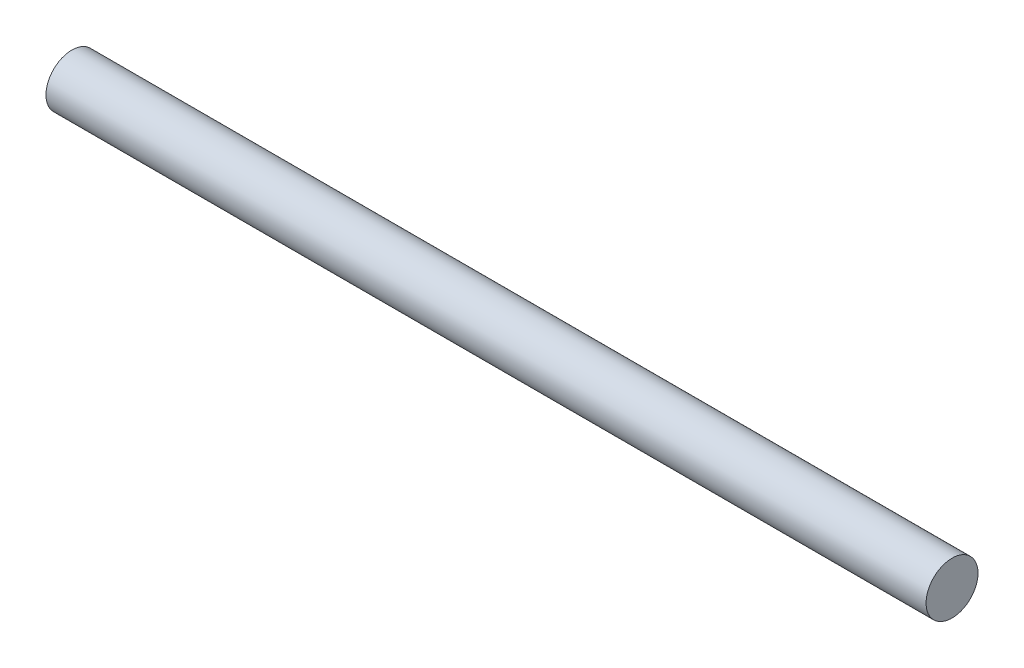
ISO-10303-21;
HEADER;
FILE_DESCRIPTION(('STEP AP214'),'2;1');
FILE_NAME('part.step','',(''),(''),'','','');
FILE_SCHEMA(('AUTOMOTIVE_DESIGN { 1 0 10303 214 1 1 1 1 }'));
ENDSEC;
DATA;
#1=APPLICATION_CONTEXT('core data for automotive mechanical design processes');
#2=APPLICATION_PROTOCOL_DEFINITION('international standard','automotive_design',2000,#1);
#3=PRODUCT_CONTEXT('',#1,'mechanical');
#4=PRODUCT('Part','Part','',(#3));
#5=PRODUCT_RELATED_PRODUCT_CATEGORY('part','',(#4));
#6=PRODUCT_DEFINITION_FORMATION('','',#4);
#7=PRODUCT_DEFINITION_CONTEXT('part definition',#1,'design');
#8=PRODUCT_DEFINITION('design','',#6,#7);
#9=PRODUCT_DEFINITION_SHAPE('','',#8);
#10=(LENGTH_UNIT() NAMED_UNIT(*) SI_UNIT(.MILLI.,.METRE.));
#11=(NAMED_UNIT(*) PLANE_ANGLE_UNIT() SI_UNIT($,.RADIAN.));
#12=(NAMED_UNIT(*) SI_UNIT($,.STERADIAN.) SOLID_ANGLE_UNIT());
#13=UNCERTAINTY_MEASURE_WITH_UNIT(LENGTH_MEASURE(1.E-05),#10,'distance_accuracy_value','');
#14=(GEOMETRIC_REPRESENTATION_CONTEXT(3) GLOBAL_UNCERTAINTY_ASSIGNED_CONTEXT((#13)) GLOBAL_UNIT_ASSIGNED_CONTEXT((#10,
#11,#12)) REPRESENTATION_CONTEXT('',''));
#15=CARTESIAN_POINT('',(0.,0.,0.));
#16=DIRECTION('',(0.,0.,1.));
#17=DIRECTION('',(1.,0.,0.));
#18=AXIS2_PLACEMENT_3D('',#15,#16,#17);
#19=CARTESIAN_POINT('',(50.,0.,0.));
#20=DIRECTION('',(-1.,0.,0.));
#21=DIRECTION('',(0.,0.,1.));
#22=AXIS2_PLACEMENT_3D('',#19,#20,#21);
#23=CYLINDRICAL_SURFACE('',#22,1.475);
#24=CARTESIAN_POINT('',(50.,0.,0.));
#25=DIRECTION('',(1.,0.,0.));
#26=DIRECTION('',(0.,0.,-1.));
#27=AXIS2_PLACEMENT_3D('',#24,#25,#26);
#28=CIRCLE('',#27,1.475);
#29=CARTESIAN_POINT('',(50.,0.,-1.475));
#30=VERTEX_POINT('',#29);
#31=EDGE_CURVE('E10',#30,#30,#28,.T.);
#32=ORIENTED_EDGE('',*,*,#31,.F.);
#33=EDGE_LOOP('',(#32));
#34=FACE_BOUND('',#33,.T.);
#35=CARTESIAN_POINT('',(0.,0.,0.));
#36=DIRECTION('',(1.,0.,0.));
#37=DIRECTION('',(0.,0.,-1.));
#38=AXIS2_PLACEMENT_3D('',#35,#36,#37);
#39=CIRCLE('',#38,1.475);
#40=CARTESIAN_POINT('',(0.,0.,-1.475));
#41=VERTEX_POINT('',#40);
#42=EDGE_CURVE('E35',#41,#41,#39,.T.);
#43=ORIENTED_EDGE('',*,*,#42,.T.);
#44=EDGE_LOOP('',(#43));
#45=FACE_BOUND('',#44,.T.);
#46=ADVANCED_FACE('F32',(#34,#45),#23,.T.);
#47=CARTESIAN_POINT('',(50.,0.,0.));
#48=DIRECTION('',(1.,0.,0.));
#49=DIRECTION('',(0.,0.,-1.));
#50=AXIS2_PLACEMENT_3D('',#47,#48,#49);
#51=PLANE('',#50);
#52=ORIENTED_EDGE('',*,*,#31,.T.);
#53=EDGE_LOOP('',(#52));
#54=FACE_BOUND('',#53,.T.);
#55=ADVANCED_FACE('F47',(#54),#51,.T.);
#56=CARTESIAN_POINT('',(0.,0.,0.));
#57=DIRECTION('',(1.,0.,0.));
#58=DIRECTION('',(0.,0.,-1.));
#59=AXIS2_PLACEMENT_3D('',#56,#57,#58);
#60=PLANE('',#59);
#61=ORIENTED_EDGE('',*,*,#42,.F.);
#62=EDGE_LOOP('',(#61));
#63=FACE_BOUND('',#62,.T.);
#64=ADVANCED_FACE('F45',(#63),#60,.F.);
#65=CLOSED_SHELL('',(#46,#55,#64));
#66=MANIFOLD_SOLID_BREP('B2',#65);
#67=ADVANCED_BREP_SHAPE_REPRESENTATION('',(#18,#66),#14);
#68=SHAPE_DEFINITION_REPRESENTATION(#9,#67);
ENDSEC;
END-ISO-10303-21;
